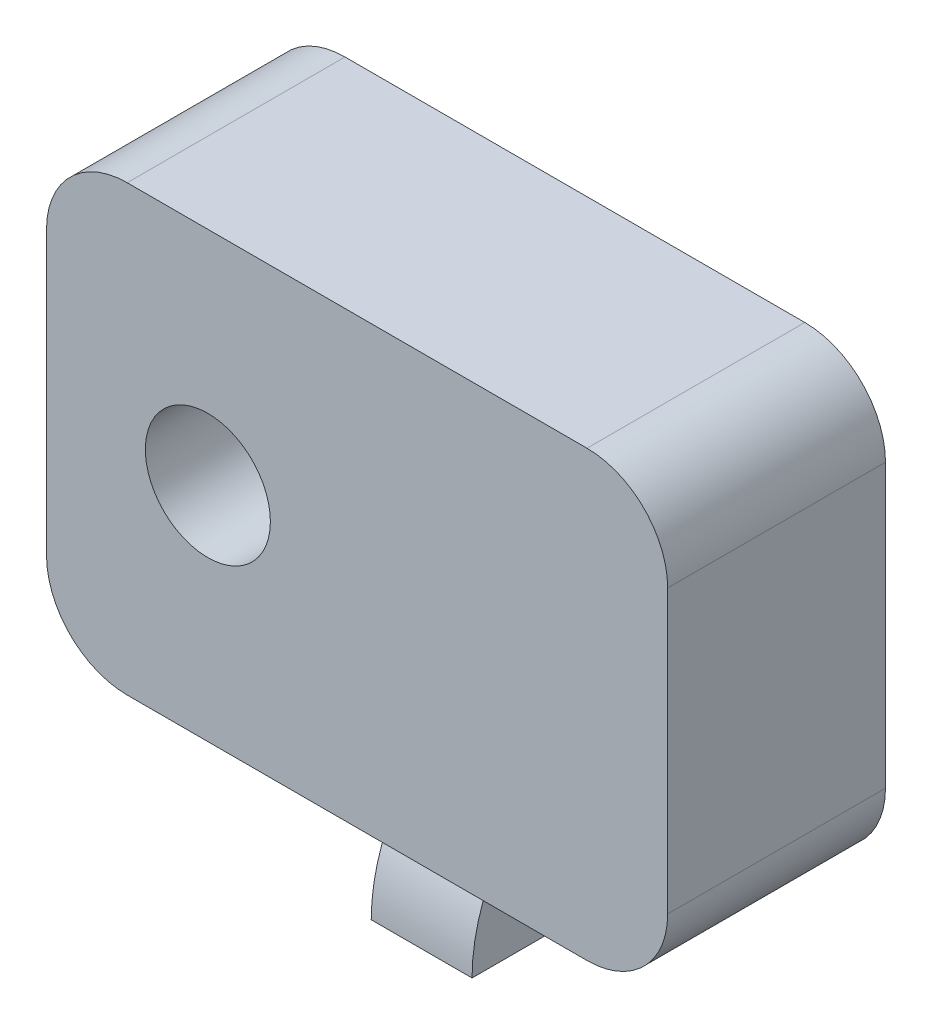
ISO-10303-21;
HEADER;
FILE_DESCRIPTION(('STEP AP214'),'2;1');
FILE_NAME('part.step','',(''),(''),'','','');
FILE_SCHEMA(('AUTOMOTIVE_DESIGN { 1 0 10303 214 1 1 1 1 }'));
ENDSEC;
DATA;
#1=APPLICATION_CONTEXT('core data for automotive mechanical design processes');
#2=APPLICATION_PROTOCOL_DEFINITION('international standard','automotive_design',2000,#1);
#3=PRODUCT_CONTEXT('',#1,'mechanical');
#4=PRODUCT('Part','Part','',(#3));
#5=PRODUCT_RELATED_PRODUCT_CATEGORY('part','',(#4));
#6=PRODUCT_DEFINITION_FORMATION('','',#4);
#7=PRODUCT_DEFINITION_CONTEXT('part definition',#1,'design');
#8=PRODUCT_DEFINITION('design','',#6,#7);
#9=PRODUCT_DEFINITION_SHAPE('','',#8);
#10=(LENGTH_UNIT() NAMED_UNIT(*) SI_UNIT(.MILLI.,.METRE.));
#11=(NAMED_UNIT(*) PLANE_ANGLE_UNIT() SI_UNIT($,.RADIAN.));
#12=(NAMED_UNIT(*) SI_UNIT($,.STERADIAN.) SOLID_ANGLE_UNIT());
#13=UNCERTAINTY_MEASURE_WITH_UNIT(LENGTH_MEASURE(1.E-05),#10,'distance_accuracy_value','');
#14=(GEOMETRIC_REPRESENTATION_CONTEXT(3) GLOBAL_UNCERTAINTY_ASSIGNED_CONTEXT((#13)) GLOBAL_UNIT_ASSIGNED_CONTEXT((#10,
#11,#12)) REPRESENTATION_CONTEXT('',''));
#15=CARTESIAN_POINT('',(0.,0.,0.));
#16=DIRECTION('',(0.,0.,1.));
#17=DIRECTION('',(1.,0.,0.));
#18=AXIS2_PLACEMENT_3D('',#15,#16,#17);
#19=CARTESIAN_POINT('',(0.,0.,27.));
#20=DIRECTION('',(0.,1.,0.));
#21=DIRECTION('',(0.,0.,1.));
#22=AXIS2_PLACEMENT_3D('',#19,#20,#21);
#23=PLANE('',#22);
#24=DIRECTION('',(1.,0.,0.));
#25=VECTOR('',#24,1.);
#26=CARTESIAN_POINT('',(0.,0.,27.));
#27=LINE('',#26,#25);
#28=CARTESIAN_POINT('',(-67.,0.,27.));
#29=VERTEX_POINT('',#28);
#30=CARTESIAN_POINT('',(-10.,0.,27.));
#31=VERTEX_POINT('',#30);
#32=EDGE_CURVE('E233',#29,#31,#27,.T.);
#33=ORIENTED_EDGE('',*,*,#32,.F.);
#34=DIRECTION('',(0.,0.,-1.));
#35=VECTOR('',#34,1.);
#36=CARTESIAN_POINT('',(-67.,0.,27.));
#37=LINE('',#36,#35);
#38=CARTESIAN_POINT('',(-67.,0.,0.));
#39=VERTEX_POINT('',#38);
#40=EDGE_CURVE('E248',#29,#39,#37,.T.);
#41=ORIENTED_EDGE('',*,*,#40,.T.);
#42=DIRECTION('',(1.,0.,0.));
#43=VECTOR('',#42,1.);
#44=CARTESIAN_POINT('',(0.,0.,0.));
#45=LINE('',#44,#43);
#46=CARTESIAN_POINT('',(-10.,0.,0.));
#47=VERTEX_POINT('',#46);
#48=EDGE_CURVE('E227',#39,#47,#45,.T.);
#49=ORIENTED_EDGE('',*,*,#48,.T.);
#50=DIRECTION('',(0.,0.,-1.));
#51=VECTOR('',#50,1.);
#52=CARTESIAN_POINT('',(-10.,0.,27.));
#53=LINE('',#52,#51);
#54=EDGE_CURVE('E236',#47,#31,#53,.F.);
#55=ORIENTED_EDGE('',*,*,#54,.T.);
#56=EDGE_LOOP('',(#33,#41,#49,#55));
#57=FACE_BOUND('',#56,.T.);
#58=DIRECTION('',(-1.,0.,0.));
#59=VECTOR('',#58,1.);
#60=CARTESIAN_POINT('',(-32.25,0.,16.));
#61=LINE('',#60,#59);
#62=CARTESIAN_POINT('',(-32.25,0.,16.));
#63=VERTEX_POINT('',#62);
#64=CARTESIAN_POINT('',(-44.75,0.,16.));
#65=VERTEX_POINT('',#64);
#66=EDGE_CURVE('E57',#63,#65,#61,.T.);
#67=ORIENTED_EDGE('',*,*,#66,.F.);
#68=DIRECTION('',(0.,0.,1.));
#69=VECTOR('',#68,1.);
#70=CARTESIAN_POINT('',(-32.25,0.,16.));
#71=LINE('',#70,#69);
#72=CARTESIAN_POINT('',(-32.25,0.,2.));
#73=VERTEX_POINT('',#72);
#74=EDGE_CURVE('E181',#73,#63,#71,.T.);
#75=ORIENTED_EDGE('',*,*,#74,.F.);
#76=DIRECTION('',(-1.,0.,0.));
#77=VECTOR('',#76,1.);
#78=CARTESIAN_POINT('',(-32.25,0.,2.));
#79=LINE('',#78,#77);
#80=CARTESIAN_POINT('',(-44.75,0.,2.));
#81=VERTEX_POINT('',#80);
#82=EDGE_CURVE('E196',#73,#81,#79,.T.);
#83=ORIENTED_EDGE('',*,*,#82,.T.);
#84=DIRECTION('',(0.,0.,1.));
#85=VECTOR('',#84,1.);
#86=CARTESIAN_POINT('',(-44.75,0.,16.));
#87=LINE('',#86,#85);
#88=EDGE_CURVE('E62',#81,#65,#87,.T.);
#89=ORIENTED_EDGE('',*,*,#88,.T.);
#90=EDGE_LOOP('',(#67,#75,#83,#89));
#91=FACE_BOUND('',#90,.T.);
#92=ADVANCED_FACE('F42',(#57,#91),#23,.F.);
#93=CARTESIAN_POINT('',(0.,0.,27.));
#94=DIRECTION('',(-1.,0.,0.));
#95=DIRECTION('',(0.,0.,1.));
#96=AXIS2_PLACEMENT_3D('',#93,#94,#95);
#97=PLANE('',#96);
#98=DIRECTION('',(0.,1.,0.));
#99=VECTOR('',#98,1.);
#100=CARTESIAN_POINT('',(0.,0.,27.));
#101=LINE('',#100,#99);
#102=CARTESIAN_POINT('',(0.,10.,27.));
#103=VERTEX_POINT('',#102);
#104=CARTESIAN_POINT('',(0.,45.,27.));
#105=VERTEX_POINT('',#104);
#106=EDGE_CURVE('E223',#103,#105,#101,.T.);
#107=ORIENTED_EDGE('',*,*,#106,.F.);
#108=DIRECTION('',(0.,0.,-1.));
#109=VECTOR('',#108,1.);
#110=CARTESIAN_POINT('',(0.,10.,27.));
#111=LINE('',#110,#109);
#112=CARTESIAN_POINT('',(0.,10.,0.));
#113=VERTEX_POINT('',#112);
#114=EDGE_CURVE('E274',#103,#113,#111,.T.);
#115=ORIENTED_EDGE('',*,*,#114,.T.);
#116=DIRECTION('',(0.,1.,0.));
#117=VECTOR('',#116,1.);
#118=CARTESIAN_POINT('',(0.,0.,0.));
#119=LINE('',#118,#117);
#120=CARTESIAN_POINT('',(0.,45.,0.));
#121=VERTEX_POINT('',#120);
#122=EDGE_CURVE('E222',#113,#121,#119,.T.);
#123=ORIENTED_EDGE('',*,*,#122,.T.);
#124=DIRECTION('',(0.,0.,-1.));
#125=VECTOR('',#124,1.);
#126=CARTESIAN_POINT('',(0.,45.,27.));
#127=LINE('',#126,#125);
#128=EDGE_CURVE('E272',#121,#105,#127,.F.);
#129=ORIENTED_EDGE('',*,*,#128,.T.);
#130=EDGE_LOOP('',(#107,#115,#123,#129));
#131=FACE_BOUND('',#130,.T.);
#132=ADVANCED_FACE('F313',(#131),#97,.F.);
#133=CARTESIAN_POINT('',(0.,55.,27.));
#134=DIRECTION('',(0.,-1.,0.));
#135=DIRECTION('',(1.,0.,0.));
#136=AXIS2_PLACEMENT_3D('',#133,#134,#135);
#137=PLANE('',#136);
#138=DIRECTION('',(-1.,0.,0.));
#139=VECTOR('',#138,1.);
#140=CARTESIAN_POINT('',(0.,55.,0.));
#141=LINE('',#140,#139);
#142=CARTESIAN_POINT('',(-10.,55.,0.));
#143=VERTEX_POINT('',#142);
#144=CARTESIAN_POINT('',(-67.,55.,0.));
#145=VERTEX_POINT('',#144);
#146=EDGE_CURVE('E239',#143,#145,#141,.T.);
#147=ORIENTED_EDGE('',*,*,#146,.T.);
#148=DIRECTION('',(0.,0.,-1.));
#149=VECTOR('',#148,1.);
#150=CARTESIAN_POINT('',(-67.,55.,27.));
#151=LINE('',#150,#149);
#152=CARTESIAN_POINT('',(-67.,55.,27.));
#153=VERTEX_POINT('',#152);
#154=EDGE_CURVE('E11',#145,#153,#151,.F.);
#155=ORIENTED_EDGE('',*,*,#154,.T.);
#156=DIRECTION('',(-1.,0.,0.));
#157=VECTOR('',#156,1.);
#158=CARTESIAN_POINT('',(0.,55.,27.));
#159=LINE('',#158,#157);
#160=CARTESIAN_POINT('',(-10.,55.,27.));
#161=VERTEX_POINT('',#160);
#162=EDGE_CURVE('E226',#161,#153,#159,.T.);
#163=ORIENTED_EDGE('',*,*,#162,.F.);
#164=DIRECTION('',(0.,0.,-1.));
#165=VECTOR('',#164,1.);
#166=CARTESIAN_POINT('',(-10.,55.,27.));
#167=LINE('',#166,#165);
#168=EDGE_CURVE('E50',#161,#143,#167,.T.);
#169=ORIENTED_EDGE('',*,*,#168,.T.);
#170=EDGE_LOOP('',(#147,#155,#163,#169));
#171=FACE_BOUND('',#170,.T.);
#172=ADVANCED_FACE('F281',(#171),#137,.F.);
#173=CARTESIAN_POINT('',(-77.,0.,27.));
#174=DIRECTION('',(1.,0.,0.));
#175=DIRECTION('',(0.,0.,-1.));
#176=AXIS2_PLACEMENT_3D('',#173,#174,#175);
#177=PLANE('',#176);
#178=DIRECTION('',(0.,-1.,0.));
#179=VECTOR('',#178,1.);
#180=CARTESIAN_POINT('',(-77.,0.,0.));
#181=LINE('',#180,#179);
#182=CARTESIAN_POINT('',(-77.,45.,0.));
#183=VERTEX_POINT('',#182);
#184=CARTESIAN_POINT('',(-77.,10.,0.));
#185=VERTEX_POINT('',#184);
#186=EDGE_CURVE('E242',#183,#185,#181,.T.);
#187=ORIENTED_EDGE('',*,*,#186,.T.);
#188=DIRECTION('',(0.,0.,-1.));
#189=VECTOR('',#188,1.);
#190=CARTESIAN_POINT('',(-77.,10.,27.));
#191=LINE('',#190,#189);
#192=CARTESIAN_POINT('',(-77.,10.,27.));
#193=VERTEX_POINT('',#192);
#194=EDGE_CURVE('E262',#185,#193,#191,.F.);
#195=ORIENTED_EDGE('',*,*,#194,.T.);
#196=DIRECTION('',(0.,-1.,0.));
#197=VECTOR('',#196,1.);
#198=CARTESIAN_POINT('',(-77.,0.,27.));
#199=LINE('',#198,#197);
#200=CARTESIAN_POINT('',(-77.,45.,27.));
#201=VERTEX_POINT('',#200);
#202=EDGE_CURVE('E230',#201,#193,#199,.T.);
#203=ORIENTED_EDGE('',*,*,#202,.F.);
#204=DIRECTION('',(0.,0.,-1.));
#205=VECTOR('',#204,1.);
#206=CARTESIAN_POINT('',(-77.,45.,27.));
#207=LINE('',#206,#205);
#208=EDGE_CURVE('E259',#201,#183,#207,.T.);
#209=ORIENTED_EDGE('',*,*,#208,.T.);
#210=EDGE_LOOP('',(#187,#195,#203,#209));
#211=FACE_BOUND('',#210,.T.);
#212=ADVANCED_FACE('F296',(#211),#177,.F.);
#213=CARTESIAN_POINT('',(0.,0.,27.));
#214=DIRECTION('',(0.,0.,1.));
#215=DIRECTION('',(1.,0.,0.));
#216=AXIS2_PLACEMENT_3D('',#213,#214,#215);
#217=PLANE('',#216);
#218=CARTESIAN_POINT('',(-57.,27.5,27.));
#219=DIRECTION('',(0.,0.,1.));
#220=DIRECTION('',(1.,0.,0.));
#221=AXIS2_PLACEMENT_3D('',#218,#219,#220);
#222=CIRCLE('',#221,7.75);
#223=CARTESIAN_POINT('',(-49.25,27.5,27.));
#224=VERTEX_POINT('',#223);
#225=EDGE_CURVE('E175',#224,#224,#222,.T.);
#226=ORIENTED_EDGE('',*,*,#225,.F.);
#227=EDGE_LOOP('',(#226));
#228=FACE_BOUND('',#227,.T.);
#229=ORIENTED_EDGE('',*,*,#202,.T.);
#230=CARTESIAN_POINT('',(-67.,10.,27.));
#231=DIRECTION('',(0.,0.,1.));
#232=DIRECTION('',(1.,0.,0.));
#233=AXIS2_PLACEMENT_3D('',#230,#231,#232);
#234=CIRCLE('',#233,10.);
#235=EDGE_CURVE('E270',#193,#29,#234,.T.);
#236=ORIENTED_EDGE('',*,*,#235,.T.);
#237=ORIENTED_EDGE('',*,*,#32,.T.);
#238=CARTESIAN_POINT('',(-10.,10.,27.));
#239=DIRECTION('',(0.,0.,1.));
#240=DIRECTION('',(1.,0.,0.));
#241=AXIS2_PLACEMENT_3D('',#238,#239,#240);
#242=CIRCLE('',#241,10.);
#243=EDGE_CURVE('E268',#31,#103,#242,.T.);
#244=ORIENTED_EDGE('',*,*,#243,.T.);
#245=ORIENTED_EDGE('',*,*,#106,.T.);
#246=CARTESIAN_POINT('',(-10.,45.,27.));
#247=DIRECTION('',(0.,0.,1.));
#248=DIRECTION('',(1.,0.,0.));
#249=AXIS2_PLACEMENT_3D('',#246,#247,#248);
#250=CIRCLE('',#249,10.);
#251=EDGE_CURVE('E264',#105,#161,#250,.T.);
#252=ORIENTED_EDGE('',*,*,#251,.T.);
#253=ORIENTED_EDGE('',*,*,#162,.T.);
#254=CARTESIAN_POINT('',(-67.,45.,27.));
#255=DIRECTION('',(0.,0.,1.));
#256=DIRECTION('',(1.,0.,0.));
#257=AXIS2_PLACEMENT_3D('',#254,#255,#256);
#258=CIRCLE('',#257,10.);
#259=EDGE_CURVE('E266',#153,#201,#258,.T.);
#260=ORIENTED_EDGE('',*,*,#259,.T.);
#261=EDGE_LOOP('',(#229,#236,#237,#244,#245,#252,#253,#260));
#262=FACE_BOUND('',#261,.T.);
#263=ADVANCED_FACE('F300',(#228,#262),#217,.T.);
#264=CARTESIAN_POINT('',(0.,0.,0.));
#265=DIRECTION('',(0.,0.,1.));
#266=DIRECTION('',(1.,0.,0.));
#267=AXIS2_PLACEMENT_3D('',#264,#265,#266);
#268=PLANE('',#267);
#269=ORIENTED_EDGE('',*,*,#48,.F.);
#270=CARTESIAN_POINT('',(-67.,10.,0.));
#271=DIRECTION('',(0.,0.,1.));
#272=DIRECTION('',(1.,0.,0.));
#273=AXIS2_PLACEMENT_3D('',#270,#271,#272);
#274=CIRCLE('',#273,10.);
#275=EDGE_CURVE('E257',#39,#185,#274,.F.);
#276=ORIENTED_EDGE('',*,*,#275,.T.);
#277=ORIENTED_EDGE('',*,*,#186,.F.);
#278=CARTESIAN_POINT('',(-67.,45.,0.));
#279=DIRECTION('',(0.,0.,1.));
#280=DIRECTION('',(1.,0.,0.));
#281=AXIS2_PLACEMENT_3D('',#278,#279,#280);
#282=CIRCLE('',#281,10.);
#283=EDGE_CURVE('E253',#183,#145,#282,.F.);
#284=ORIENTED_EDGE('',*,*,#283,.T.);
#285=ORIENTED_EDGE('',*,*,#146,.F.);
#286=CARTESIAN_POINT('',(-10.,45.,0.));
#287=DIRECTION('',(0.,0.,1.));
#288=DIRECTION('',(1.,0.,0.));
#289=AXIS2_PLACEMENT_3D('',#286,#287,#288);
#290=CIRCLE('',#289,10.);
#291=EDGE_CURVE('E251',#143,#121,#290,.F.);
#292=ORIENTED_EDGE('',*,*,#291,.T.);
#293=ORIENTED_EDGE('',*,*,#122,.F.);
#294=CARTESIAN_POINT('',(-10.,10.,0.));
#295=DIRECTION('',(0.,0.,1.));
#296=DIRECTION('',(1.,0.,0.));
#297=AXIS2_PLACEMENT_3D('',#294,#295,#296);
#298=CIRCLE('',#297,10.);
#299=EDGE_CURVE('E255',#113,#47,#298,.F.);
#300=ORIENTED_EDGE('',*,*,#299,.T.);
#301=EDGE_LOOP('',(#269,#276,#277,#284,#285,#292,#293,#300));
#302=FACE_BOUND('',#301,.T.);
#303=ADVANCED_FACE('F287',(#302),#268,.F.);
#304=CARTESIAN_POINT('',(-67.,10.,27.));
#305=DIRECTION('',(0.,0.,-1.));
#306=DIRECTION('',(-1.,0.,0.));
#307=AXIS2_PLACEMENT_3D('',#304,#305,#306);
#308=CYLINDRICAL_SURFACE('',#307,10.);
#309=ORIENTED_EDGE('',*,*,#235,.F.);
#310=ORIENTED_EDGE('',*,*,#194,.F.);
#311=ORIENTED_EDGE('',*,*,#275,.F.);
#312=ORIENTED_EDGE('',*,*,#40,.F.);
#313=EDGE_LOOP('',(#309,#310,#311,#312));
#314=FACE_BOUND('',#313,.T.);
#315=ADVANCED_FACE('F304',(#314),#308,.T.);
#316=CARTESIAN_POINT('',(-10.,10.,27.));
#317=DIRECTION('',(0.,0.,-1.));
#318=DIRECTION('',(-1.,0.,0.));
#319=AXIS2_PLACEMENT_3D('',#316,#317,#318);
#320=CYLINDRICAL_SURFACE('',#319,10.);
#321=ORIENTED_EDGE('',*,*,#243,.F.);
#322=ORIENTED_EDGE('',*,*,#54,.F.);
#323=ORIENTED_EDGE('',*,*,#299,.F.);
#324=ORIENTED_EDGE('',*,*,#114,.F.);
#325=EDGE_LOOP('',(#321,#322,#323,#324));
#326=FACE_BOUND('',#325,.T.);
#327=ADVANCED_FACE('F310',(#326),#320,.T.);
#328=CARTESIAN_POINT('',(-67.,45.,27.));
#329=DIRECTION('',(0.,0.,-1.));
#330=DIRECTION('',(-1.,0.,0.));
#331=AXIS2_PLACEMENT_3D('',#328,#329,#330);
#332=CYLINDRICAL_SURFACE('',#331,10.);
#333=ORIENTED_EDGE('',*,*,#259,.F.);
#334=ORIENTED_EDGE('',*,*,#154,.F.);
#335=ORIENTED_EDGE('',*,*,#283,.F.);
#336=ORIENTED_EDGE('',*,*,#208,.F.);
#337=EDGE_LOOP('',(#333,#334,#335,#336));
#338=FACE_BOUND('',#337,.T.);
#339=ADVANCED_FACE('F293',(#338),#332,.T.);
#340=CARTESIAN_POINT('',(-10.,45.,27.));
#341=DIRECTION('',(0.,0.,-1.));
#342=DIRECTION('',(-1.,0.,0.));
#343=AXIS2_PLACEMENT_3D('',#340,#341,#342);
#344=CYLINDRICAL_SURFACE('',#343,10.);
#345=ORIENTED_EDGE('',*,*,#251,.F.);
#346=ORIENTED_EDGE('',*,*,#128,.F.);
#347=ORIENTED_EDGE('',*,*,#291,.F.);
#348=ORIENTED_EDGE('',*,*,#168,.F.);
#349=EDGE_LOOP('',(#345,#346,#347,#348));
#350=FACE_BOUND('',#349,.T.);
#351=ADVANCED_FACE('F44',(#350),#344,.T.);
#352=CARTESIAN_POINT('',(-32.25,-13.1736478302819,5.94021003373054));
#353=DIRECTION('',(-1.,0.,0.));
#354=DIRECTION('',(0.,0.,1.));
#355=AXIS2_PLACEMENT_3D('',#352,#353,#354);
#356=PLANE('',#355);
#357=ORIENTED_EDGE('',*,*,#74,.T.);
#358=DIRECTION('',(0.,-1.,0.));
#359=VECTOR('',#358,1.);
#360=CARTESIAN_POINT('',(-32.25,-6.,16.));
#361=LINE('',#360,#359);
#362=CARTESIAN_POINT('',(-32.25,-6.,16.));
#363=VERTEX_POINT('',#362);
#364=EDGE_CURVE('E184',#63,#363,#361,.T.);
#365=ORIENTED_EDGE('',*,*,#364,.T.);
#366=CARTESIAN_POINT('',(-32.25,-17.,-2.66666666666667));
#367=DIRECTION('',(1.,0.,0.));
#368=DIRECTION('',(0.,0.,1.));
#369=AXIS2_PLACEMENT_3D('',#366,#367,#368);
#370=CIRCLE('',#369,21.6666666666667);
#371=CARTESIAN_POINT('',(-32.25,-17.,19.));
#372=VERTEX_POINT('',#371);
#373=EDGE_CURVE('E187',#363,#372,#370,.T.);
#374=ORIENTED_EDGE('',*,*,#373,.T.);
#375=DIRECTION('',(0.,0.,-1.));
#376=VECTOR('',#375,1.);
#377=CARTESIAN_POINT('',(-32.25,-17.,8.30854891853851));
#378=LINE('',#377,#376);
#379=CARTESIAN_POINT('',(-32.25,-17.,8.30854891853851));
#380=VERTEX_POINT('',#379);
#381=EDGE_CURVE('E189',#372,#380,#378,.T.);
#382=ORIENTED_EDGE('',*,*,#381,.T.);
#383=CARTESIAN_POINT('',(-32.25,-13.1736478302819,5.94021003373054));
#384=DIRECTION('',(1.,0.,0.));
#385=DIRECTION('',(0.,0.,1.));
#386=AXIS2_PLACEMENT_3D('',#383,#384,#385);
#387=CIRCLE('',#386,4.5);
#388=CARTESIAN_POINT('',(-32.25,-11.,2.));
#389=VERTEX_POINT('',#388);
#390=EDGE_CURVE('E191',#380,#389,#387,.T.);
#391=ORIENTED_EDGE('',*,*,#390,.T.);
#392=DIRECTION('',(0.,1.,0.));
#393=VECTOR('',#392,1.);
#394=CARTESIAN_POINT('',(-32.25,0.,2.));
#395=LINE('',#394,#393);
#396=EDGE_CURVE('E193',#389,#73,#395,.T.);
#397=ORIENTED_EDGE('',*,*,#396,.T.);
#398=EDGE_LOOP('',(#357,#365,#374,#382,#391,#397));
#399=FACE_BOUND('',#398,.T.);
#400=CARTESIAN_POINT('',(-32.25,-13.1736478302819,5.94021003373054));
#401=DIRECTION('',(1.,0.,0.));
#402=DIRECTION('',(0.,0.,-1.));
#403=AXIS2_PLACEMENT_3D('',#400,#401,#402);
#404=CIRCLE('',#403,1.9);
#405=CARTESIAN_POINT('',(-32.25,-11.7005558440163,4.74021003373054));
#406=VERTEX_POINT('',#405);
#407=CARTESIAN_POINT('',(-32.25,-14.6467398165475,4.74021003373054));
#408=VERTEX_POINT('',#407);
#409=EDGE_CURVE('E163',#406,#408,#404,.T.);
#410=ORIENTED_EDGE('',*,*,#409,.F.);
#411=DIRECTION('',(0.,1.,0.));
#412=VECTOR('',#411,1.);
#413=CARTESIAN_POINT('',(-32.25,-11.7005558440163,4.74021003373054));
#414=LINE('',#413,#412);
#415=EDGE_CURVE('E153',#408,#406,#414,.T.);
#416=ORIENTED_EDGE('',*,*,#415,.F.);
#417=EDGE_LOOP('',(#410,#416));
#418=FACE_BOUND('',#417,.T.);
#419=ADVANCED_FACE('F170',(#399,#418),#356,.F.);
#420=CARTESIAN_POINT('',(-44.75,-13.1736478302819,5.94021003373054));
#421=DIRECTION('',(-1.,0.,0.));
#422=DIRECTION('',(0.,0.,1.));
#423=AXIS2_PLACEMENT_3D('',#420,#421,#422);
#424=PLANE('',#423);
#425=ORIENTED_EDGE('',*,*,#88,.F.);
#426=DIRECTION('',(0.,1.,0.));
#427=VECTOR('',#426,1.);
#428=CARTESIAN_POINT('',(-44.75,0.,2.));
#429=LINE('',#428,#427);
#430=CARTESIAN_POINT('',(-44.75,-11.,2.));
#431=VERTEX_POINT('',#430);
#432=EDGE_CURVE('E185',#431,#81,#429,.T.);
#433=ORIENTED_EDGE('',*,*,#432,.F.);
#434=CARTESIAN_POINT('',(-44.75,-13.1736478302819,5.94021003373054));
#435=DIRECTION('',(1.,0.,0.));
#436=DIRECTION('',(0.,0.,1.));
#437=AXIS2_PLACEMENT_3D('',#434,#435,#436);
#438=CIRCLE('',#437,4.5);
#439=CARTESIAN_POINT('',(-44.75,-17.,8.30854891853851));
#440=VERTEX_POINT('',#439);
#441=EDGE_CURVE('E204',#440,#431,#438,.T.);
#442=ORIENTED_EDGE('',*,*,#441,.F.);
#443=DIRECTION('',(0.,0.,-1.));
#444=VECTOR('',#443,1.);
#445=CARTESIAN_POINT('',(-44.75,-17.,8.30854891853851));
#446=LINE('',#445,#444);
#447=CARTESIAN_POINT('',(-44.75,-17.,19.));
#448=VERTEX_POINT('',#447);
#449=EDGE_CURVE('E202',#448,#440,#446,.T.);
#450=ORIENTED_EDGE('',*,*,#449,.F.);
#451=CARTESIAN_POINT('',(-44.75,-17.,-2.66666666666667));
#452=DIRECTION('',(1.,0.,0.));
#453=DIRECTION('',(0.,0.,1.));
#454=AXIS2_PLACEMENT_3D('',#451,#452,#453);
#455=CIRCLE('',#454,21.6666666666667);
#456=CARTESIAN_POINT('',(-44.75,-6.,16.));
#457=VERTEX_POINT('',#456);
#458=EDGE_CURVE('E200',#457,#448,#455,.T.);
#459=ORIENTED_EDGE('',*,*,#458,.F.);
#460=DIRECTION('',(0.,-1.,0.));
#461=VECTOR('',#460,1.);
#462=CARTESIAN_POINT('',(-44.75,-6.,16.));
#463=LINE('',#462,#461);
#464=EDGE_CURVE('E198',#65,#457,#463,.T.);
#465=ORIENTED_EDGE('',*,*,#464,.F.);
#466=EDGE_LOOP('',(#425,#433,#442,#450,#459,#465));
#467=FACE_BOUND('',#466,.T.);
#468=DIRECTION('',(0.,1.,0.));
#469=VECTOR('',#468,1.);
#470=CARTESIAN_POINT('',(-44.75,-11.7005558440163,4.74021003373054));
#471=LINE('',#470,#469);
#472=CARTESIAN_POINT('',(-44.75,-14.6467398165475,4.74021003373054));
#473=VERTEX_POINT('',#472);
#474=CARTESIAN_POINT('',(-44.75,-11.7005558440163,4.74021003373054));
#475=VERTEX_POINT('',#474);
#476=EDGE_CURVE('E171',#473,#475,#471,.T.);
#477=ORIENTED_EDGE('',*,*,#476,.T.);
#478=CARTESIAN_POINT('',(-44.75,-13.1736478302819,5.94021003373054));
#479=DIRECTION('',(1.,0.,0.));
#480=DIRECTION('',(0.,0.,-1.));
#481=AXIS2_PLACEMENT_3D('',#478,#479,#480);
#482=CIRCLE('',#481,1.9);
#483=EDGE_CURVE('E168',#475,#473,#482,.T.);
#484=ORIENTED_EDGE('',*,*,#483,.T.);
#485=EDGE_LOOP('',(#477,#484));
#486=FACE_BOUND('',#485,.T.);
#487=ADVANCED_FACE('F320',(#467,#486),#424,.T.);
#488=CARTESIAN_POINT('',(-32.25,-6.,16.));
#489=DIRECTION('',(0.,0.,-1.));
#490=DIRECTION('',(-1.,0.,0.));
#491=AXIS2_PLACEMENT_3D('',#488,#489,#490);
#492=PLANE('',#491);
#493=ORIENTED_EDGE('',*,*,#464,.T.);
#494=DIRECTION('',(-1.,0.,0.));
#495=VECTOR('',#494,1.);
#496=CARTESIAN_POINT('',(-32.25,-6.,16.));
#497=LINE('',#496,#495);
#498=EDGE_CURVE('E218',#363,#457,#497,.T.);
#499=ORIENTED_EDGE('',*,*,#498,.F.);
#500=ORIENTED_EDGE('',*,*,#364,.F.);
#501=ORIENTED_EDGE('',*,*,#66,.T.);
#502=EDGE_LOOP('',(#493,#499,#500,#501));
#503=FACE_BOUND('',#502,.T.);
#504=ADVANCED_FACE('F374',(#503),#492,.F.);
#505=CARTESIAN_POINT('',(-32.25,-17.,-2.66666666666667));
#506=DIRECTION('',(-1.,0.,0.));
#507=DIRECTION('',(0.,0.,1.));
#508=AXIS2_PLACEMENT_3D('',#505,#506,#507);
#509=CYLINDRICAL_SURFACE('',#508,21.6666666666667);
#510=ORIENTED_EDGE('',*,*,#458,.T.);
#511=DIRECTION('',(-1.,0.,0.));
#512=VECTOR('',#511,1.);
#513=CARTESIAN_POINT('',(-32.25,-17.,19.));
#514=LINE('',#513,#512);
#515=EDGE_CURVE('E215',#372,#448,#514,.T.);
#516=ORIENTED_EDGE('',*,*,#515,.F.);
#517=ORIENTED_EDGE('',*,*,#373,.F.);
#518=ORIENTED_EDGE('',*,*,#498,.T.);
#519=EDGE_LOOP('',(#510,#516,#517,#518));
#520=FACE_BOUND('',#519,.T.);
#521=ADVANCED_FACE('F385',(#520),#509,.T.);
#522=CARTESIAN_POINT('',(-32.25,-17.,8.30854891853851));
#523=DIRECTION('',(0.,1.,0.));
#524=DIRECTION('',(0.,0.,1.));
#525=AXIS2_PLACEMENT_3D('',#522,#523,#524);
#526=PLANE('',#525);
#527=ORIENTED_EDGE('',*,*,#449,.T.);
#528=DIRECTION('',(-1.,0.,0.));
#529=VECTOR('',#528,1.);
#530=CARTESIAN_POINT('',(-32.25,-17.,8.30854891853851));
#531=LINE('',#530,#529);
#532=EDGE_CURVE('E212',#380,#440,#531,.T.);
#533=ORIENTED_EDGE('',*,*,#532,.F.);
#534=ORIENTED_EDGE('',*,*,#381,.F.);
#535=ORIENTED_EDGE('',*,*,#515,.T.);
#536=EDGE_LOOP('',(#527,#533,#534,#535));
#537=FACE_BOUND('',#536,.T.);
#538=ADVANCED_FACE('F396',(#537),#526,.F.);
#539=CARTESIAN_POINT('',(-32.25,-13.1736478302819,5.94021003373054));
#540=DIRECTION('',(-1.,0.,0.));
#541=DIRECTION('',(0.,0.,1.));
#542=AXIS2_PLACEMENT_3D('',#539,#540,#541);
#543=CYLINDRICAL_SURFACE('',#542,4.5);
#544=ORIENTED_EDGE('',*,*,#441,.T.);
#545=DIRECTION('',(-1.,0.,0.));
#546=VECTOR('',#545,1.);
#547=CARTESIAN_POINT('',(-32.25,-11.,2.));
#548=LINE('',#547,#546);
#549=EDGE_CURVE('E209',#389,#431,#548,.T.);
#550=ORIENTED_EDGE('',*,*,#549,.F.);
#551=ORIENTED_EDGE('',*,*,#390,.F.);
#552=ORIENTED_EDGE('',*,*,#532,.T.);
#553=EDGE_LOOP('',(#544,#550,#551,#552));
#554=FACE_BOUND('',#553,.T.);
#555=ADVANCED_FACE('F407',(#554),#543,.T.);
#556=CARTESIAN_POINT('',(-32.25,0.,2.));
#557=DIRECTION('',(0.,0.,1.));
#558=DIRECTION('',(0.,-1.,0.));
#559=AXIS2_PLACEMENT_3D('',#556,#557,#558);
#560=PLANE('',#559);
#561=ORIENTED_EDGE('',*,*,#432,.T.);
#562=ORIENTED_EDGE('',*,*,#82,.F.);
#563=ORIENTED_EDGE('',*,*,#396,.F.);
#564=ORIENTED_EDGE('',*,*,#549,.T.);
#565=EDGE_LOOP('',(#561,#562,#563,#564));
#566=FACE_BOUND('',#565,.T.);
#567=ADVANCED_FACE('F418',(#566),#560,.F.);
#568=CARTESIAN_POINT('',(-32.25,-13.1736478302819,5.94021003373054));
#569=DIRECTION('',(-1.,0.,0.));
#570=DIRECTION('',(0.,0.,1.));
#571=AXIS2_PLACEMENT_3D('',#568,#569,#570);
#572=CYLINDRICAL_SURFACE('',#571,1.9);
#573=ORIENTED_EDGE('',*,*,#483,.F.);
#574=DIRECTION('',(-1.,0.,0.));
#575=VECTOR('',#574,1.);
#576=CARTESIAN_POINT('',(-32.25,-11.7005558440163,4.74021003373054));
#577=LINE('',#576,#575);
#578=EDGE_CURVE('E156',#406,#475,#577,.T.);
#579=ORIENTED_EDGE('',*,*,#578,.F.);
#580=ORIENTED_EDGE('',*,*,#409,.T.);
#581=DIRECTION('',(-1.,0.,0.));
#582=VECTOR('',#581,1.);
#583=CARTESIAN_POINT('',(-32.25,-14.6467398165475,4.74021003373054));
#584=LINE('',#583,#582);
#585=EDGE_CURVE('E159',#408,#473,#584,.T.);
#586=ORIENTED_EDGE('',*,*,#585,.T.);
#587=EDGE_LOOP('',(#573,#579,#580,#586));
#588=FACE_BOUND('',#587,.T.);
#589=ADVANCED_FACE('F166',(#588),#572,.F.);
#590=CARTESIAN_POINT('',(-32.25,-11.7005558440163,4.74021003373054));
#591=DIRECTION('',(0.,0.,1.));
#592=DIRECTION('',(0.,-1.,0.));
#593=AXIS2_PLACEMENT_3D('',#590,#591,#592);
#594=PLANE('',#593);
#595=ORIENTED_EDGE('',*,*,#476,.F.);
#596=ORIENTED_EDGE('',*,*,#585,.F.);
#597=ORIENTED_EDGE('',*,*,#415,.T.);
#598=ORIENTED_EDGE('',*,*,#578,.T.);
#599=EDGE_LOOP('',(#595,#596,#597,#598));
#600=FACE_BOUND('',#599,.T.);
#601=ADVANCED_FACE('F155',(#600),#594,.T.);
#602=CARTESIAN_POINT('',(-57.,27.5,14.5));
#603=DIRECTION('',(0.,0.,1.));
#604=DIRECTION('',(1.,0.,0.));
#605=AXIS2_PLACEMENT_3D('',#602,#603,#604);
#606=CYLINDRICAL_SURFACE('',#605,7.75);
#607=CARTESIAN_POINT('',(-57.,27.5,14.5));
#608=DIRECTION('',(0.,0.,1.));
#609=DIRECTION('',(1.,0.,0.));
#610=AXIS2_PLACEMENT_3D('',#607,#608,#609);
#611=CIRCLE('',#610,7.75);
#612=CARTESIAN_POINT('',(-49.25,27.5,14.5));
#613=VERTEX_POINT('',#612);
#614=EDGE_CURVE('E178',#613,#613,#611,.T.);
#615=ORIENTED_EDGE('',*,*,#614,.F.);
#616=EDGE_LOOP('',(#615));
#617=FACE_BOUND('',#616,.T.);
#618=ORIENTED_EDGE('',*,*,#225,.T.);
#619=EDGE_LOOP('',(#618));
#620=FACE_BOUND('',#619,.T.);
#621=ADVANCED_FACE('F448',(#617,#620),#606,.F.);
#622=CARTESIAN_POINT('',(-57.,27.5,14.5));
#623=DIRECTION('',(0.,0.,1.));
#624=DIRECTION('',(1.,0.,0.));
#625=AXIS2_PLACEMENT_3D('',#622,#623,#624);
#626=PLANE('',#625);
#627=ORIENTED_EDGE('',*,*,#614,.T.);
#628=EDGE_LOOP('',(#627));
#629=FACE_BOUND('',#628,.T.);
#630=ADVANCED_FACE('F469',(#629),#626,.T.);
#631=CLOSED_SHELL('',(#92,#132,#172,#212,#263,#303,#315,#327,#339,#351,#419,#487,#504,#521,#538,
#555,#567,#589,#601,#621,#630));
#632=MANIFOLD_SOLID_BREP('B2',#631);
#633=ADVANCED_BREP_SHAPE_REPRESENTATION('',(#18,#632),#14);
#634=SHAPE_DEFINITION_REPRESENTATION(#9,#633);
ENDSEC;
END-ISO-10303-21;
